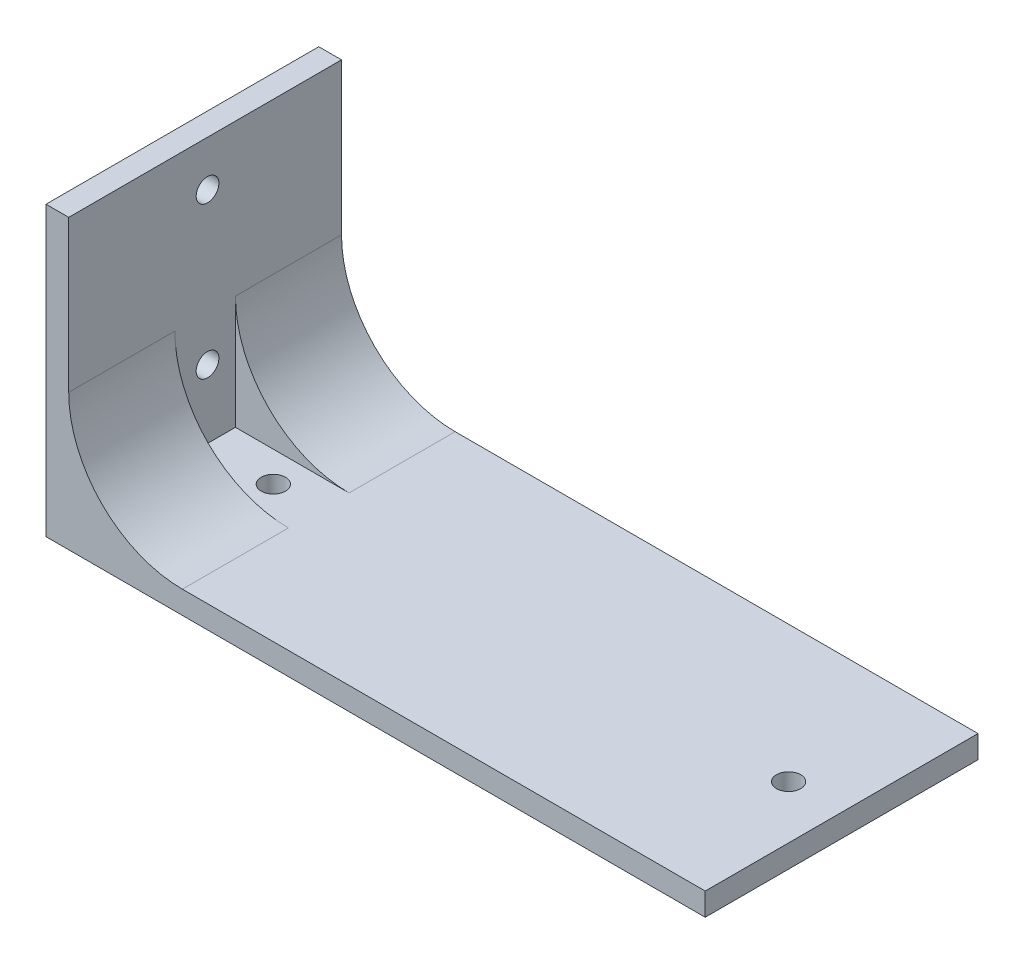
ISO-10303-21;
HEADER;
FILE_DESCRIPTION(('STEP AP214'),'2;1');
FILE_NAME('part.step','',(''),(''),'','','');
FILE_SCHEMA(('AUTOMOTIVE_DESIGN { 1 0 10303 214 1 1 1 1 }'));
ENDSEC;
DATA;
#1=APPLICATION_CONTEXT('core data for automotive mechanical design processes');
#2=APPLICATION_PROTOCOL_DEFINITION('international standard','automotive_design',2000,#1);
#3=PRODUCT_CONTEXT('',#1,'mechanical');
#4=PRODUCT('Part','Part','',(#3));
#5=PRODUCT_RELATED_PRODUCT_CATEGORY('part','',(#4));
#6=PRODUCT_DEFINITION_FORMATION('','',#4);
#7=PRODUCT_DEFINITION_CONTEXT('part definition',#1,'design');
#8=PRODUCT_DEFINITION('design','',#6,#7);
#9=PRODUCT_DEFINITION_SHAPE('','',#8);
#10=(LENGTH_UNIT() NAMED_UNIT(*) SI_UNIT(.MILLI.,.METRE.));
#11=(NAMED_UNIT(*) PLANE_ANGLE_UNIT() SI_UNIT($,.RADIAN.));
#12=(NAMED_UNIT(*) SI_UNIT($,.STERADIAN.) SOLID_ANGLE_UNIT());
#13=UNCERTAINTY_MEASURE_WITH_UNIT(LENGTH_MEASURE(1.E-05),#10,'distance_accuracy_value','');
#14=(GEOMETRIC_REPRESENTATION_CONTEXT(3) GLOBAL_UNCERTAINTY_ASSIGNED_CONTEXT((#13)) GLOBAL_UNIT_ASSIGNED_CONTEXT((#10,
#11,#12)) REPRESENTATION_CONTEXT('',''));
#15=CARTESIAN_POINT('',(0.,0.,0.));
#16=DIRECTION('',(0.,0.,1.));
#17=DIRECTION('',(1.,0.,0.));
#18=AXIS2_PLACEMENT_3D('',#15,#16,#17);
#19=CARTESIAN_POINT('',(0.,3.,0.));
#20=DIRECTION('',(0.,1.,0.));
#21=DIRECTION('',(0.,0.,1.));
#22=AXIS2_PLACEMENT_3D('',#19,#20,#21);
#23=PLANE('',#22);
#24=CARTESIAN_POINT('',(46.7755905511811,3.,4.64173228346457));
#25=DIRECTION('',(0.,1.,0.));
#26=DIRECTION('',(0.,0.,1.));
#27=AXIS2_PLACEMENT_3D('',#24,#25,#26);
#28=CIRCLE('',#27,1.6);
#29=CARTESIAN_POINT('',(46.7755905511811,3.,6.24173228346457));
#30=VERTEX_POINT('',#29);
#31=EDGE_CURVE('E154',#30,#30,#28,.T.);
#32=ORIENTED_EDGE('',*,*,#31,.F.);
#33=EDGE_LOOP('',(#32));
#34=FACE_BOUND('',#33,.T.);
#35=CARTESIAN_POINT('',(-21.2244094488189,3.,4.64173228346457));
#36=DIRECTION('',(0.,1.,0.));
#37=DIRECTION('',(0.,0.,1.));
#38=AXIS2_PLACEMENT_3D('',#35,#36,#37);
#39=CIRCLE('',#38,1.6);
#40=CARTESIAN_POINT('',(-21.2244094488189,3.,6.24173228346458));
#41=VERTEX_POINT('',#40);
#42=EDGE_CURVE('E148',#41,#41,#39,.T.);
#43=ORIENTED_EDGE('',*,*,#42,.F.);
#44=EDGE_LOOP('',(#43));
#45=FACE_BOUND('',#44,.T.);
#46=DIRECTION('',(1.,0.,0.));
#47=VECTOR('',#46,1.);
#48=CARTESIAN_POINT('',(-33.2244094488189,3.,0.641732283464575));
#49=LINE('',#48,#47);
#50=CARTESIAN_POINT('',(-30.2244094488189,3.,0.641732283464575));
#51=VERTEX_POINT('',#50);
#52=CARTESIAN_POINT('',(-15.2244094488189,3.,0.641732283464575));
#53=VERTEX_POINT('',#52);
#54=EDGE_CURVE('E123',#51,#53,#49,.T.);
#55=ORIENTED_EDGE('',*,*,#54,.F.);
#56=DIRECTION('',(0.,0.,-1.));
#57=VECTOR('',#56,1.);
#58=CARTESIAN_POINT('',(-30.2244094488189,3.,0.641732283464575));
#59=LINE('',#58,#57);
#60=CARTESIAN_POINT('',(-30.2244094488189,3.,8.64173228346457));
#61=VERTEX_POINT('',#60);
#62=EDGE_CURVE('E112',#61,#51,#59,.T.);
#63=ORIENTED_EDGE('',*,*,#62,.F.);
#64=DIRECTION('',(-1.,0.,0.));
#65=VECTOR('',#64,1.);
#66=CARTESIAN_POINT('',(-30.2244094488189,3.,8.64173228346457));
#67=LINE('',#66,#65);
#68=CARTESIAN_POINT('',(-15.2244094488189,3.,8.64173228346457));
#69=VERTEX_POINT('',#68);
#70=EDGE_CURVE('E55',#69,#61,#67,.T.);
#71=ORIENTED_EDGE('',*,*,#70,.F.);
#72=DIRECTION('',(0.,0.,-1.));
#73=VECTOR('',#72,1.);
#74=CARTESIAN_POINT('',(-15.2244094488189,3.,0.));
#75=LINE('',#74,#73);
#76=CARTESIAN_POINT('',(-15.2244094488189,3.,22.6417322834646));
#77=VERTEX_POINT('',#76);
#78=EDGE_CURVE('E190',#69,#77,#75,.F.);
#79=ORIENTED_EDGE('',*,*,#78,.T.);
#80=DIRECTION('',(1.,0.,0.));
#81=VECTOR('',#80,1.);
#82=CARTESIAN_POINT('',(-33.2244094488189,3.,22.6417322834646));
#83=LINE('',#82,#81);
#84=CARTESIAN_POINT('',(53.7755905511811,3.,22.6417322834646));
#85=VERTEX_POINT('',#84);
#86=EDGE_CURVE('E160',#77,#85,#83,.T.);
#87=ORIENTED_EDGE('',*,*,#86,.T.);
#88=DIRECTION('',(0.,0.,-1.));
#89=VECTOR('',#88,1.);
#90=CARTESIAN_POINT('',(53.7755905511811,3.,-13.3582677165354));
#91=LINE('',#90,#89);
#92=CARTESIAN_POINT('',(53.7755905511811,3.,-13.3582677165354));
#93=VERTEX_POINT('',#92);
#94=EDGE_CURVE('E162',#85,#93,#91,.T.);
#95=ORIENTED_EDGE('',*,*,#94,.T.);
#96=DIRECTION('',(-1.,0.,0.));
#97=VECTOR('',#96,1.);
#98=CARTESIAN_POINT('',(-33.2244094488189,3.,-13.3582677165354));
#99=LINE('',#98,#97);
#100=CARTESIAN_POINT('',(-15.2244094488189,3.,-13.3582677165354));
#101=VERTEX_POINT('',#100);
#102=EDGE_CURVE('E165',#93,#101,#99,.T.);
#103=ORIENTED_EDGE('',*,*,#102,.T.);
#104=DIRECTION('',(0.,0.,-1.));
#105=VECTOR('',#104,1.);
#106=CARTESIAN_POINT('',(-15.2244094488189,3.,0.));
#107=LINE('',#106,#105);
#108=EDGE_CURVE('E188',#101,#53,#107,.F.);
#109=ORIENTED_EDGE('',*,*,#108,.T.);
#110=EDGE_LOOP('',(#55,#63,#71,#79,#87,#95,#103,#109));
#111=FACE_BOUND('',#110,.T.);
#112=ADVANCED_FACE('F33',(#34,#45,#111),#23,.T.);
#113=CARTESIAN_POINT('',(-33.2244094488189,38.,0.641732283464575));
#114=DIRECTION('',(0.,0.,-1.));
#115=DIRECTION('',(-1.,0.,0.));
#116=AXIS2_PLACEMENT_3D('',#113,#114,#115);
#117=PLANE('',#116);
#118=DIRECTION('',(0.,-1.,0.));
#119=VECTOR('',#118,1.);
#120=CARTESIAN_POINT('',(-30.2244094488189,38.,0.641732283464575));
#121=LINE('',#120,#119);
#122=CARTESIAN_POINT('',(-30.2244094488189,18.,0.641732283464575));
#123=VERTEX_POINT('',#122);
#124=EDGE_CURVE('E119',#123,#51,#121,.T.);
#125=ORIENTED_EDGE('',*,*,#124,.T.);
#126=ORIENTED_EDGE('',*,*,#54,.T.);
#127=CARTESIAN_POINT('',(-15.2244094488189,18.,0.641732283464575));
#128=DIRECTION('',(0.,0.,-1.));
#129=DIRECTION('',(-1.,0.,0.));
#130=AXIS2_PLACEMENT_3D('',#127,#128,#129);
#131=CIRCLE('',#130,15.);
#132=EDGE_CURVE('E11',#53,#123,#131,.T.);
#133=ORIENTED_EDGE('',*,*,#132,.T.);
#134=EDGE_LOOP('',(#125,#126,#133));
#135=FACE_BOUND('',#134,.T.);
#136=ADVANCED_FACE('F205',(#135),#117,.F.);
#137=CARTESIAN_POINT('',(-30.2244094488189,38.,8.64173228346457));
#138=DIRECTION('',(0.,0.,1.));
#139=DIRECTION('',(1.,0.,0.));
#140=AXIS2_PLACEMENT_3D('',#137,#138,#139);
#141=PLANE('',#140);
#142=DIRECTION('',(0.,-1.,0.));
#143=VECTOR('',#142,1.);
#144=CARTESIAN_POINT('',(-30.2244094488189,38.,8.64173228346457));
#145=LINE('',#144,#143);
#146=CARTESIAN_POINT('',(-30.2244094488189,18.,8.64173228346457));
#147=VERTEX_POINT('',#146);
#148=EDGE_CURVE('E110',#147,#61,#145,.T.);
#149=ORIENTED_EDGE('',*,*,#148,.F.);
#150=CARTESIAN_POINT('',(-15.2244094488189,18.,8.64173228346457));
#151=DIRECTION('',(0.,0.,1.));
#152=DIRECTION('',(1.,0.,0.));
#153=AXIS2_PLACEMENT_3D('',#150,#151,#152);
#154=CIRCLE('',#153,15.);
#155=EDGE_CURVE('E127',#147,#69,#154,.T.);
#156=ORIENTED_EDGE('',*,*,#155,.T.);
#157=ORIENTED_EDGE('',*,*,#70,.T.);
#158=EDGE_LOOP('',(#149,#156,#157));
#159=FACE_BOUND('',#158,.T.);
#160=ADVANCED_FACE('F126',(#159),#141,.F.);
#161=CARTESIAN_POINT('',(0.,0.,0.));
#162=DIRECTION('',(0.,1.,0.));
#163=DIRECTION('',(0.,0.,1.));
#164=AXIS2_PLACEMENT_3D('',#161,#162,#163);
#165=PLANE('',#164);
#166=DIRECTION('',(0.,0.,1.));
#167=VECTOR('',#166,1.);
#168=CARTESIAN_POINT('',(-33.2244094488189,0.,-13.3582677165354));
#169=LINE('',#168,#167);
#170=CARTESIAN_POINT('',(-33.2244094488189,0.,-13.3582677165354));
#171=VERTEX_POINT('',#170);
#172=CARTESIAN_POINT('',(-33.2244094488189,0.,22.6417322834646));
#173=VERTEX_POINT('',#172);
#174=EDGE_CURVE('E157',#171,#173,#169,.T.);
#175=ORIENTED_EDGE('',*,*,#174,.F.);
#176=DIRECTION('',(-1.,0.,0.));
#177=VECTOR('',#176,1.);
#178=CARTESIAN_POINT('',(-33.2244094488189,0.,-13.3582677165354));
#179=LINE('',#178,#177);
#180=CARTESIAN_POINT('',(53.7755905511811,0.,-13.3582677165354));
#181=VERTEX_POINT('',#180);
#182=EDGE_CURVE('E163',#181,#171,#179,.T.);
#183=ORIENTED_EDGE('',*,*,#182,.F.);
#184=DIRECTION('',(0.,0.,-1.));
#185=VECTOR('',#184,1.);
#186=CARTESIAN_POINT('',(53.7755905511811,0.,-13.3582677165354));
#187=LINE('',#186,#185);
#188=CARTESIAN_POINT('',(53.7755905511811,0.,22.6417322834646));
#189=VERTEX_POINT('',#188);
#190=EDGE_CURVE('E173',#189,#181,#187,.T.);
#191=ORIENTED_EDGE('',*,*,#190,.F.);
#192=DIRECTION('',(1.,0.,0.));
#193=VECTOR('',#192,1.);
#194=CARTESIAN_POINT('',(-33.2244094488189,0.,22.6417322834646));
#195=LINE('',#194,#193);
#196=EDGE_CURVE('E171',#173,#189,#195,.T.);
#197=ORIENTED_EDGE('',*,*,#196,.F.);
#198=EDGE_LOOP('',(#175,#183,#191,#197));
#199=FACE_BOUND('',#198,.T.);
#200=CARTESIAN_POINT('',(46.7755905511811,0.,4.64173228346457));
#201=DIRECTION('',(0.,1.,0.));
#202=DIRECTION('',(0.,0.,1.));
#203=AXIS2_PLACEMENT_3D('',#200,#201,#202);
#204=CIRCLE('',#203,1.6);
#205=CARTESIAN_POINT('',(46.7755905511811,0.,6.24173228346457));
#206=VERTEX_POINT('',#205);
#207=EDGE_CURVE('E151',#206,#206,#204,.T.);
#208=ORIENTED_EDGE('',*,*,#207,.T.);
#209=EDGE_LOOP('',(#208));
#210=FACE_BOUND('',#209,.T.);
#211=CARTESIAN_POINT('',(-21.2244094488189,0.,4.64173228346457));
#212=DIRECTION('',(0.,1.,0.));
#213=DIRECTION('',(0.,0.,1.));
#214=AXIS2_PLACEMENT_3D('',#211,#212,#213);
#215=CIRCLE('',#214,1.6);
#216=CARTESIAN_POINT('',(-21.2244094488189,0.,6.24173228346458));
#217=VERTEX_POINT('',#216);
#218=EDGE_CURVE('E147',#217,#217,#215,.T.);
#219=ORIENTED_EDGE('',*,*,#218,.T.);
#220=EDGE_LOOP('',(#219));
#221=FACE_BOUND('',#220,.T.);
#222=ADVANCED_FACE('F240',(#199,#210,#221),#165,.F.);
#223=CARTESIAN_POINT('',(-33.2244094488189,3.,-13.3582677165354));
#224=DIRECTION('',(1.,0.,0.));
#225=DIRECTION('',(0.,0.,-1.));
#226=AXIS2_PLACEMENT_3D('',#223,#224,#225);
#227=PLANE('',#226);
#228=CARTESIAN_POINT('',(-33.2244094488189,12.,4.32453466176242));
#229=DIRECTION('',(1.,0.,0.));
#230=DIRECTION('',(0.,0.,-1.));
#231=AXIS2_PLACEMENT_3D('',#228,#229,#230);
#232=CIRCLE('',#231,1.5);
#233=CARTESIAN_POINT('',(-33.2244094488189,12.,2.82453466176242));
#234=VERTEX_POINT('',#233);
#235=EDGE_CURVE('E213',#234,#234,#232,.T.);
#236=ORIENTED_EDGE('',*,*,#235,.T.);
#237=EDGE_LOOP('',(#236));
#238=FACE_BOUND('',#237,.T.);
#239=CARTESIAN_POINT('',(-33.2244094488189,32.,4.32453466176242));
#240=DIRECTION('',(1.,0.,0.));
#241=DIRECTION('',(0.,0.,-1.));
#242=AXIS2_PLACEMENT_3D('',#239,#240,#241);
#243=CIRCLE('',#242,1.5);
#244=CARTESIAN_POINT('',(-33.2244094488189,32.,2.82453466176242));
#245=VERTEX_POINT('',#244);
#246=EDGE_CURVE('E124',#245,#245,#243,.T.);
#247=ORIENTED_EDGE('',*,*,#246,.T.);
#248=EDGE_LOOP('',(#247));
#249=FACE_BOUND('',#248,.T.);
#250=ORIENTED_EDGE('',*,*,#174,.T.);
#251=DIRECTION('',(0.,-1.,0.));
#252=VECTOR('',#251,1.);
#253=CARTESIAN_POINT('',(-33.2244094488189,3.,22.6417322834646));
#254=LINE('',#253,#252);
#255=CARTESIAN_POINT('',(-33.2244094488189,38.,22.6417322834646));
#256=VERTEX_POINT('',#255);
#257=EDGE_CURVE('E184',#256,#173,#254,.T.);
#258=ORIENTED_EDGE('',*,*,#257,.F.);
#259=DIRECTION('',(0.,0.,1.));
#260=VECTOR('',#259,1.);
#261=CARTESIAN_POINT('',(-33.2244094488189,38.,-13.3582677165354));
#262=LINE('',#261,#260);
#263=CARTESIAN_POINT('',(-33.2244094488189,38.,-13.3582677165354));
#264=VERTEX_POINT('',#263);
#265=EDGE_CURVE('E136',#264,#256,#262,.T.);
#266=ORIENTED_EDGE('',*,*,#265,.F.);
#267=DIRECTION('',(0.,-1.,0.));
#268=VECTOR('',#267,1.);
#269=CARTESIAN_POINT('',(-33.2244094488189,3.,-13.3582677165354));
#270=LINE('',#269,#268);
#271=EDGE_CURVE('E168',#264,#171,#270,.T.);
#272=ORIENTED_EDGE('',*,*,#271,.T.);
#273=EDGE_LOOP('',(#250,#258,#266,#272));
#274=FACE_BOUND('',#273,.T.);
#275=ADVANCED_FACE('F236',(#238,#249,#274),#227,.F.);
#276=CARTESIAN_POINT('',(-33.2244094488189,3.,22.6417322834646));
#277=DIRECTION('',(0.,0.,-1.));
#278=DIRECTION('',(-1.,0.,0.));
#279=AXIS2_PLACEMENT_3D('',#276,#277,#278);
#280=PLANE('',#279);
#281=ORIENTED_EDGE('',*,*,#196,.T.);
#282=DIRECTION('',(0.,-1.,0.));
#283=VECTOR('',#282,1.);
#284=CARTESIAN_POINT('',(53.7755905511811,3.,22.6417322834646));
#285=LINE('',#284,#283);
#286=EDGE_CURVE('E181',#85,#189,#285,.T.);
#287=ORIENTED_EDGE('',*,*,#286,.F.);
#288=ORIENTED_EDGE('',*,*,#86,.F.);
#289=CARTESIAN_POINT('',(-15.2244094488189,18.,22.6417322834646));
#290=DIRECTION('',(0.,0.,-1.));
#291=DIRECTION('',(-1.,0.,0.));
#292=AXIS2_PLACEMENT_3D('',#289,#290,#291);
#293=CIRCLE('',#292,15.);
#294=CARTESIAN_POINT('',(-30.2244094488189,18.,22.6417322834646));
#295=VERTEX_POINT('',#294);
#296=EDGE_CURVE('E195',#77,#295,#293,.T.);
#297=ORIENTED_EDGE('',*,*,#296,.T.);
#298=DIRECTION('',(0.,-1.,0.));
#299=VECTOR('',#298,1.);
#300=CARTESIAN_POINT('',(-30.2244094488189,38.,22.6417322834646));
#301=LINE('',#300,#299);
#302=CARTESIAN_POINT('',(-30.2244094488189,38.,22.6417322834646));
#303=VERTEX_POINT('',#302);
#304=EDGE_CURVE('E132',#303,#295,#301,.T.);
#305=ORIENTED_EDGE('',*,*,#304,.F.);
#306=DIRECTION('',(1.,0.,0.));
#307=VECTOR('',#306,1.);
#308=CARTESIAN_POINT('',(-30.2244094488189,38.,22.6417322834646));
#309=LINE('',#308,#307);
#310=EDGE_CURVE('E129',#256,#303,#309,.T.);
#311=ORIENTED_EDGE('',*,*,#310,.F.);
#312=ORIENTED_EDGE('',*,*,#257,.T.);
#313=EDGE_LOOP('',(#281,#287,#288,#297,#305,#311,#312));
#314=FACE_BOUND('',#313,.T.);
#315=ADVANCED_FACE('F239',(#314),#280,.F.);
#316=CARTESIAN_POINT('',(53.7755905511811,3.,-13.3582677165354));
#317=DIRECTION('',(-1.,0.,0.));
#318=DIRECTION('',(0.,0.,1.));
#319=AXIS2_PLACEMENT_3D('',#316,#317,#318);
#320=PLANE('',#319);
#321=ORIENTED_EDGE('',*,*,#190,.T.);
#322=DIRECTION('',(0.,-1.,0.));
#323=VECTOR('',#322,1.);
#324=CARTESIAN_POINT('',(53.7755905511811,3.,-13.3582677165354));
#325=LINE('',#324,#323);
#326=EDGE_CURVE('E178',#93,#181,#325,.T.);
#327=ORIENTED_EDGE('',*,*,#326,.F.);
#328=ORIENTED_EDGE('',*,*,#94,.F.);
#329=ORIENTED_EDGE('',*,*,#286,.T.);
#330=EDGE_LOOP('',(#321,#327,#328,#329));
#331=FACE_BOUND('',#330,.T.);
#332=ADVANCED_FACE('F256',(#331),#320,.F.);
#333=CARTESIAN_POINT('',(-33.2244094488189,3.,-13.3582677165354));
#334=DIRECTION('',(0.,0.,1.));
#335=DIRECTION('',(1.,0.,0.));
#336=AXIS2_PLACEMENT_3D('',#333,#334,#335);
#337=PLANE('',#336);
#338=ORIENTED_EDGE('',*,*,#182,.T.);
#339=ORIENTED_EDGE('',*,*,#271,.F.);
#340=DIRECTION('',(-1.,0.,0.));
#341=VECTOR('',#340,1.);
#342=CARTESIAN_POINT('',(-33.2244094488189,38.,-13.3582677165354));
#343=LINE('',#342,#341);
#344=CARTESIAN_POINT('',(-30.2244094488189,38.,-13.3582677165354));
#345=VERTEX_POINT('',#344);
#346=EDGE_CURVE('E140',#345,#264,#343,.T.);
#347=ORIENTED_EDGE('',*,*,#346,.F.);
#348=DIRECTION('',(0.,-1.,0.));
#349=VECTOR('',#348,1.);
#350=CARTESIAN_POINT('',(-30.2244094488189,38.,-13.3582677165354));
#351=LINE('',#350,#349);
#352=CARTESIAN_POINT('',(-30.2244094488189,18.,-13.3582677165354));
#353=VERTEX_POINT('',#352);
#354=EDGE_CURVE('E143',#345,#353,#351,.T.);
#355=ORIENTED_EDGE('',*,*,#354,.T.);
#356=CARTESIAN_POINT('',(-15.2244094488189,18.,-13.3582677165354));
#357=DIRECTION('',(0.,0.,1.));
#358=DIRECTION('',(1.,0.,0.));
#359=AXIS2_PLACEMENT_3D('',#356,#357,#358);
#360=CIRCLE('',#359,15.);
#361=EDGE_CURVE('E41',#353,#101,#360,.T.);
#362=ORIENTED_EDGE('',*,*,#361,.T.);
#363=ORIENTED_EDGE('',*,*,#102,.F.);
#364=ORIENTED_EDGE('',*,*,#326,.T.);
#365=EDGE_LOOP('',(#338,#339,#347,#355,#362,#363,#364));
#366=FACE_BOUND('',#365,.T.);
#367=ADVANCED_FACE('F198',(#366),#337,.F.);
#368=CARTESIAN_POINT('',(46.7755905511811,3.,4.64173228346457));
#369=DIRECTION('',(0.,-1.,0.));
#370=DIRECTION('',(0.,0.,-1.));
#371=AXIS2_PLACEMENT_3D('',#368,#369,#370);
#372=CYLINDRICAL_SURFACE('',#371,1.6);
#373=ORIENTED_EDGE('',*,*,#31,.T.);
#374=EDGE_LOOP('',(#373));
#375=FACE_BOUND('',#374,.T.);
#376=ORIENTED_EDGE('',*,*,#207,.F.);
#377=EDGE_LOOP('',(#376));
#378=FACE_BOUND('',#377,.T.);
#379=ADVANCED_FACE('F278',(#375,#378),#372,.F.);
#380=CARTESIAN_POINT('',(-21.2244094488189,3.,4.64173228346457));
#381=DIRECTION('',(0.,-1.,0.));
#382=DIRECTION('',(0.,0.,-1.));
#383=AXIS2_PLACEMENT_3D('',#380,#381,#382);
#384=CYLINDRICAL_SURFACE('',#383,1.6);
#385=ORIENTED_EDGE('',*,*,#42,.T.);
#386=EDGE_LOOP('',(#385));
#387=FACE_BOUND('',#386,.T.);
#388=ORIENTED_EDGE('',*,*,#218,.F.);
#389=EDGE_LOOP('',(#388));
#390=FACE_BOUND('',#389,.T.);
#391=ADVANCED_FACE('F226',(#387,#390),#384,.F.);
#392=CARTESIAN_POINT('',(-30.2244094488189,38.,-13.3582677165354));
#393=DIRECTION('',(-1.,0.,0.));
#394=DIRECTION('',(0.,0.,1.));
#395=AXIS2_PLACEMENT_3D('',#392,#393,#394);
#396=PLANE('',#395);
#397=CARTESIAN_POINT('',(-30.2244094488189,12.,4.32453466176242));
#398=DIRECTION('',(1.,0.,0.));
#399=DIRECTION('',(0.,0.,-1.));
#400=AXIS2_PLACEMENT_3D('',#397,#398,#399);
#401=CIRCLE('',#400,1.5);
#402=CARTESIAN_POINT('',(-30.2244094488189,12.,2.82453466176242));
#403=VERTEX_POINT('',#402);
#404=EDGE_CURVE('E216',#403,#403,#401,.T.);
#405=ORIENTED_EDGE('',*,*,#404,.F.);
#406=EDGE_LOOP('',(#405));
#407=FACE_BOUND('',#406,.T.);
#408=CARTESIAN_POINT('',(-30.2244094488189,32.,4.32453466176242));
#409=DIRECTION('',(1.,0.,0.));
#410=DIRECTION('',(0.,0.,-1.));
#411=AXIS2_PLACEMENT_3D('',#408,#409,#410);
#412=CIRCLE('',#411,1.5);
#413=CARTESIAN_POINT('',(-30.2244094488189,32.,2.82453466176242));
#414=VERTEX_POINT('',#413);
#415=EDGE_CURVE('E210',#414,#414,#412,.T.);
#416=ORIENTED_EDGE('',*,*,#415,.F.);
#417=EDGE_LOOP('',(#416));
#418=FACE_BOUND('',#417,.T.);
#419=DIRECTION('',(0.,0.,-1.));
#420=VECTOR('',#419,1.);
#421=CARTESIAN_POINT('',(-30.2244094488189,38.,-13.3582677165354));
#422=LINE('',#421,#420);
#423=EDGE_CURVE('E138',#303,#345,#422,.T.);
#424=ORIENTED_EDGE('',*,*,#423,.F.);
#425=ORIENTED_EDGE('',*,*,#304,.T.);
#426=DIRECTION('',(0.,0.,-1.));
#427=VECTOR('',#426,1.);
#428=CARTESIAN_POINT('',(-30.2244094488189,18.,8.64173228346457));
#429=LINE('',#428,#427);
#430=EDGE_CURVE('E116',#295,#147,#429,.T.);
#431=ORIENTED_EDGE('',*,*,#430,.T.);
#432=ORIENTED_EDGE('',*,*,#148,.T.);
#433=ORIENTED_EDGE('',*,*,#62,.T.);
#434=ORIENTED_EDGE('',*,*,#124,.F.);
#435=DIRECTION('',(0.,0.,-1.));
#436=VECTOR('',#435,1.);
#437=CARTESIAN_POINT('',(-30.2244094488189,18.,-13.3582677165354));
#438=LINE('',#437,#436);
#439=EDGE_CURVE('E192',#123,#353,#438,.T.);
#440=ORIENTED_EDGE('',*,*,#439,.T.);
#441=ORIENTED_EDGE('',*,*,#354,.F.);
#442=EDGE_LOOP('',(#424,#425,#431,#432,#433,#434,#440,#441));
#443=FACE_BOUND('',#442,.T.);
#444=ADVANCED_FACE('F111',(#407,#418,#443),#396,.F.);
#445=CARTESIAN_POINT('',(0.,38.,0.));
#446=DIRECTION('',(0.,1.,0.));
#447=DIRECTION('',(0.,0.,1.));
#448=AXIS2_PLACEMENT_3D('',#445,#446,#447);
#449=PLANE('',#448);
#450=ORIENTED_EDGE('',*,*,#265,.T.);
#451=ORIENTED_EDGE('',*,*,#310,.T.);
#452=ORIENTED_EDGE('',*,*,#423,.T.);
#453=ORIENTED_EDGE('',*,*,#346,.T.);
#454=EDGE_LOOP('',(#450,#451,#452,#453));
#455=FACE_BOUND('',#454,.T.);
#456=ADVANCED_FACE('F225',(#455),#449,.T.);
#457=CARTESIAN_POINT('',(-15.2244094488189,18.,8.64173228346457));
#458=DIRECTION('',(0.,0.,-1.));
#459=DIRECTION('',(-1.,0.,0.));
#460=AXIS2_PLACEMENT_3D('',#457,#458,#459);
#461=CYLINDRICAL_SURFACE('',#460,15.);
#462=ORIENTED_EDGE('',*,*,#296,.F.);
#463=ORIENTED_EDGE('',*,*,#78,.F.);
#464=ORIENTED_EDGE('',*,*,#155,.F.);
#465=ORIENTED_EDGE('',*,*,#430,.F.);
#466=EDGE_LOOP('',(#462,#463,#464,#465));
#467=FACE_BOUND('',#466,.T.);
#468=ADVANCED_FACE('F260',(#467),#461,.F.);
#469=CARTESIAN_POINT('',(-15.2244094488189,18.,-13.3582677165354));
#470=DIRECTION('',(0.,0.,-1.));
#471=DIRECTION('',(-1.,0.,0.));
#472=AXIS2_PLACEMENT_3D('',#469,#470,#471);
#473=CYLINDRICAL_SURFACE('',#472,15.);
#474=ORIENTED_EDGE('',*,*,#132,.F.);
#475=ORIENTED_EDGE('',*,*,#108,.F.);
#476=ORIENTED_EDGE('',*,*,#361,.F.);
#477=ORIENTED_EDGE('',*,*,#439,.F.);
#478=EDGE_LOOP('',(#474,#475,#476,#477));
#479=FACE_BOUND('',#478,.T.);
#480=ADVANCED_FACE('F35',(#479),#473,.F.);
#481=CARTESIAN_POINT('',(-60.2244094488189,32.,4.32453466176243));
#482=DIRECTION('',(1.,0.,0.));
#483=DIRECTION('',(0.,0.,-1.));
#484=AXIS2_PLACEMENT_3D('',#481,#482,#483);
#485=CYLINDRICAL_SURFACE('',#484,1.5);
#486=ORIENTED_EDGE('',*,*,#415,.T.);
#487=EDGE_LOOP('',(#486));
#488=FACE_BOUND('',#487,.T.);
#489=ORIENTED_EDGE('',*,*,#246,.F.);
#490=EDGE_LOOP('',(#489));
#491=FACE_BOUND('',#490,.T.);
#492=ADVANCED_FACE('F230',(#488,#491),#485,.F.);
#493=CARTESIAN_POINT('',(-60.2244094488189,12.,4.32453466176243));
#494=DIRECTION('',(1.,0.,0.));
#495=DIRECTION('',(0.,0.,-1.));
#496=AXIS2_PLACEMENT_3D('',#493,#494,#495);
#497=CYLINDRICAL_SURFACE('',#496,1.5);
#498=ORIENTED_EDGE('',*,*,#404,.T.);
#499=EDGE_LOOP('',(#498));
#500=FACE_BOUND('',#499,.T.);
#501=ORIENTED_EDGE('',*,*,#235,.F.);
#502=EDGE_LOOP('',(#501));
#503=FACE_BOUND('',#502,.T.);
#504=ADVANCED_FACE('F220',(#500,#503),#497,.F.);
#505=CLOSED_SHELL('',(#112,#136,#160,#222,#275,#315,#332,#367,#379,#391,#444,#456,#468,#480,
#492,#504));
#506=MANIFOLD_SOLID_BREP('B2',#505);
#507=ADVANCED_BREP_SHAPE_REPRESENTATION('',(#18,#506),#14);
#508=SHAPE_DEFINITION_REPRESENTATION(#9,#507);
ENDSEC;
END-ISO-10303-21;
